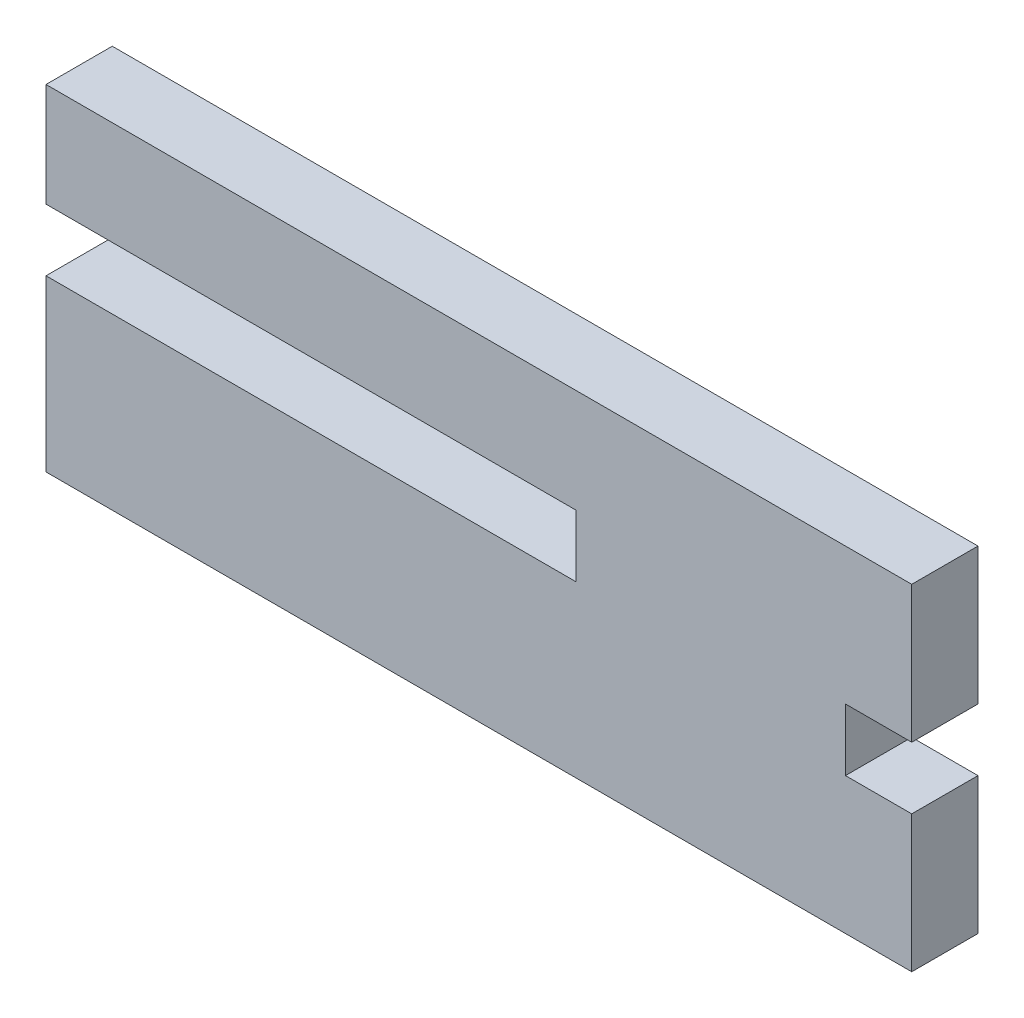
ISO-10303-21;
HEADER;
FILE_DESCRIPTION(('STEP AP214'),'2;1');
FILE_NAME('part.step','',(''),(''),'','','');
FILE_SCHEMA(('AUTOMOTIVE_DESIGN { 1 0 10303 214 1 1 1 1 }'));
ENDSEC;
DATA;
#1=APPLICATION_CONTEXT('core data for automotive mechanical design processes');
#2=APPLICATION_PROTOCOL_DEFINITION('international standard','automotive_design',2000,#1);
#3=PRODUCT_CONTEXT('',#1,'mechanical');
#4=PRODUCT('Part','Part','',(#3));
#5=PRODUCT_RELATED_PRODUCT_CATEGORY('part','',(#4));
#6=PRODUCT_DEFINITION_FORMATION('','',#4);
#7=PRODUCT_DEFINITION_CONTEXT('part definition',#1,'design');
#8=PRODUCT_DEFINITION('design','',#6,#7);
#9=PRODUCT_DEFINITION_SHAPE('','',#8);
#10=(LENGTH_UNIT() NAMED_UNIT(*) SI_UNIT(.MILLI.,.METRE.));
#11=(NAMED_UNIT(*) PLANE_ANGLE_UNIT() SI_UNIT($,.RADIAN.));
#12=(NAMED_UNIT(*) SI_UNIT($,.STERADIAN.) SOLID_ANGLE_UNIT());
#13=UNCERTAINTY_MEASURE_WITH_UNIT(LENGTH_MEASURE(1.E-05),#10,'distance_accuracy_value','');
#14=(GEOMETRIC_REPRESENTATION_CONTEXT(3) GLOBAL_UNCERTAINTY_ASSIGNED_CONTEXT((#13)) GLOBAL_UNIT_ASSIGNED_CONTEXT((#10,
#11,#12)) REPRESENTATION_CONTEXT('',''));
#15=CARTESIAN_POINT('',(0.,0.,0.));
#16=DIRECTION('',(0.,0.,1.));
#17=DIRECTION('',(1.,0.,0.));
#18=AXIS2_PLACEMENT_3D('',#15,#16,#17);
#19=CARTESIAN_POINT('',(-0.1016,11.0109,3.175));
#20=DIRECTION('',(-1.,0.,0.));
#21=DIRECTION('',(0.,0.,1.));
#22=AXIS2_PLACEMENT_3D('',#19,#20,#21);
#23=PLANE('',#22);
#24=DIRECTION('',(0.,1.,0.));
#25=VECTOR('',#24,1.);
#26=CARTESIAN_POINT('',(-0.1016,11.0109,0.));
#27=LINE('',#26,#25);
#28=CARTESIAN_POINT('',(-0.1016,11.0109,0.));
#29=VERTEX_POINT('',#28);
#30=CARTESIAN_POINT('',(-0.1016,15.9766,0.));
#31=VERTEX_POINT('',#30);
#32=EDGE_CURVE('E155',#29,#31,#27,.T.);
#33=ORIENTED_EDGE('',*,*,#32,.F.);
#34=DIRECTION('',(0.,0.,-1.));
#35=VECTOR('',#34,1.);
#36=CARTESIAN_POINT('',(-0.1016,11.0109,3.175));
#37=LINE('',#36,#35);
#38=CARTESIAN_POINT('',(-0.1016,11.0109,3.175));
#39=VERTEX_POINT('',#38);
#40=EDGE_CURVE('E11',#39,#29,#37,.T.);
#41=ORIENTED_EDGE('',*,*,#40,.F.);
#42=DIRECTION('',(0.,1.,0.));
#43=VECTOR('',#42,1.);
#44=CARTESIAN_POINT('',(-0.1016,11.0109,3.175));
#45=LINE('',#44,#43);
#46=CARTESIAN_POINT('',(-0.1016,15.9766,3.175));
#47=VERTEX_POINT('',#46);
#48=EDGE_CURVE('E184',#39,#47,#45,.T.);
#49=ORIENTED_EDGE('',*,*,#48,.T.);
#50=DIRECTION('',(0.,0.,-1.));
#51=VECTOR('',#50,1.);
#52=CARTESIAN_POINT('',(-0.1016,15.9766,3.175));
#53=LINE('',#52,#51);
#54=EDGE_CURVE('E36',#47,#31,#53,.T.);
#55=ORIENTED_EDGE('',*,*,#54,.T.);
#56=EDGE_LOOP('',(#33,#41,#49,#55));
#57=FACE_BOUND('',#56,.T.);
#58=ADVANCED_FACE('F33',(#57),#23,.T.);
#59=CARTESIAN_POINT('',(-0.1016,11.0109,3.175));
#60=DIRECTION('',(0.,1.,0.));
#61=DIRECTION('',(0.,0.,1.));
#62=AXIS2_PLACEMENT_3D('',#59,#60,#61);
#63=PLANE('',#62);
#64=DIRECTION('',(1.,0.,0.));
#65=VECTOR('',#64,1.);
#66=CARTESIAN_POINT('',(-0.1016,11.0109,0.));
#67=LINE('',#66,#65);
#68=CARTESIAN_POINT('',(25.2984,11.0109,0.));
#69=VERTEX_POINT('',#68);
#70=EDGE_CURVE('E90',#29,#69,#67,.T.);
#71=ORIENTED_EDGE('',*,*,#70,.T.);
#72=DIRECTION('',(0.,0.,-1.));
#73=VECTOR('',#72,1.);
#74=CARTESIAN_POINT('',(25.2984,11.0109,3.175));
#75=LINE('',#74,#73);
#76=CARTESIAN_POINT('',(25.2984,11.0109,3.175));
#77=VERTEX_POINT('',#76);
#78=EDGE_CURVE('E42',#77,#69,#75,.T.);
#79=ORIENTED_EDGE('',*,*,#78,.F.);
#80=DIRECTION('',(1.,0.,0.));
#81=VECTOR('',#80,1.);
#82=CARTESIAN_POINT('',(-0.1016,11.0109,3.175));
#83=LINE('',#82,#81);
#84=EDGE_CURVE('E133',#39,#77,#83,.T.);
#85=ORIENTED_EDGE('',*,*,#84,.F.);
#86=ORIENTED_EDGE('',*,*,#40,.T.);
#87=EDGE_LOOP('',(#71,#79,#85,#86));
#88=FACE_BOUND('',#87,.T.);
#89=ADVANCED_FACE('F260',(#88),#63,.F.);
#90=CARTESIAN_POINT('',(25.2984,11.0109,3.175));
#91=DIRECTION('',(1.,0.,0.));
#92=DIRECTION('',(0.,0.,-1.));
#93=AXIS2_PLACEMENT_3D('',#90,#91,#92);
#94=PLANE('',#93);
#95=DIRECTION('',(0.,-1.,0.));
#96=VECTOR('',#95,1.);
#97=CARTESIAN_POINT('',(25.2984,11.0109,0.));
#98=LINE('',#97,#96);
#99=CARTESIAN_POINT('',(25.2984,8.0391,0.));
#100=VERTEX_POINT('',#99);
#101=EDGE_CURVE('E140',#69,#100,#98,.T.);
#102=ORIENTED_EDGE('',*,*,#101,.T.);
#103=DIRECTION('',(0.,0.,-1.));
#104=VECTOR('',#103,1.);
#105=CARTESIAN_POINT('',(25.2984,8.0391,3.175));
#106=LINE('',#105,#104);
#107=CARTESIAN_POINT('',(25.2984,8.0391,3.175));
#108=VERTEX_POINT('',#107);
#109=EDGE_CURVE('E137',#108,#100,#106,.T.);
#110=ORIENTED_EDGE('',*,*,#109,.F.);
#111=DIRECTION('',(0.,-1.,0.));
#112=VECTOR('',#111,1.);
#113=CARTESIAN_POINT('',(25.2984,11.0109,3.175));
#114=LINE('',#113,#112);
#115=EDGE_CURVE('E126',#77,#108,#114,.T.);
#116=ORIENTED_EDGE('',*,*,#115,.F.);
#117=ORIENTED_EDGE('',*,*,#78,.T.);
#118=EDGE_LOOP('',(#102,#110,#116,#117));
#119=FACE_BOUND('',#118,.T.);
#120=ADVANCED_FACE('F138',(#119),#94,.F.);
#121=CARTESIAN_POINT('',(-0.1016,8.0391,3.175));
#122=DIRECTION('',(0.,1.,0.));
#123=DIRECTION('',(0.,0.,1.));
#124=AXIS2_PLACEMENT_3D('',#121,#122,#123);
#125=PLANE('',#124);
#126=DIRECTION('',(1.,0.,0.));
#127=VECTOR('',#126,1.);
#128=CARTESIAN_POINT('',(-0.1016,8.0391,0.));
#129=LINE('',#128,#127);
#130=CARTESIAN_POINT('',(-0.1016,8.0391,0.));
#131=VERTEX_POINT('',#130);
#132=EDGE_CURVE('E181',#131,#100,#129,.T.);
#133=ORIENTED_EDGE('',*,*,#132,.F.);
#134=DIRECTION('',(0.,0.,-1.));
#135=VECTOR('',#134,1.);
#136=CARTESIAN_POINT('',(-0.1016,8.0391,3.175));
#137=LINE('',#136,#135);
#138=CARTESIAN_POINT('',(-0.1016,8.0391,3.175));
#139=VERTEX_POINT('',#138);
#140=EDGE_CURVE('E144',#139,#131,#137,.T.);
#141=ORIENTED_EDGE('',*,*,#140,.F.);
#142=DIRECTION('',(1.,0.,0.));
#143=VECTOR('',#142,1.);
#144=CARTESIAN_POINT('',(-0.1016,8.0391,3.175));
#145=LINE('',#144,#143);
#146=EDGE_CURVE('E132',#139,#108,#145,.T.);
#147=ORIENTED_EDGE('',*,*,#146,.T.);
#148=ORIENTED_EDGE('',*,*,#109,.T.);
#149=EDGE_LOOP('',(#133,#141,#147,#148));
#150=FACE_BOUND('',#149,.T.);
#151=ADVANCED_FACE('F147',(#150),#125,.T.);
#152=CARTESIAN_POINT('',(-0.1016,4.7625,3.175));
#153=DIRECTION('',(-1.,0.,0.));
#154=DIRECTION('',(0.,0.,1.));
#155=AXIS2_PLACEMENT_3D('',#152,#153,#154);
#156=PLANE('',#155);
#157=DIRECTION('',(0.,1.,0.));
#158=VECTOR('',#157,1.);
#159=CARTESIAN_POINT('',(-0.1016,4.7625,0.));
#160=LINE('',#159,#158);
#161=CARTESIAN_POINT('',(-0.1016,-0.1016,0.));
#162=VERTEX_POINT('',#161);
#163=EDGE_CURVE('E178',#162,#131,#160,.T.);
#164=ORIENTED_EDGE('',*,*,#163,.F.);
#165=DIRECTION('',(0.,0.,-1.));
#166=VECTOR('',#165,1.);
#167=CARTESIAN_POINT('',(-0.1016,-0.1016,3.175));
#168=LINE('',#167,#166);
#169=CARTESIAN_POINT('',(-0.1016,-0.1016,3.175));
#170=VERTEX_POINT('',#169);
#171=EDGE_CURVE('E188',#170,#162,#168,.T.);
#172=ORIENTED_EDGE('',*,*,#171,.F.);
#173=DIRECTION('',(0.,1.,0.));
#174=VECTOR('',#173,1.);
#175=CARTESIAN_POINT('',(-0.1016,-0.1016,3.175));
#176=LINE('',#175,#174);
#177=EDGE_CURVE('E148',#170,#139,#176,.T.);
#178=ORIENTED_EDGE('',*,*,#177,.T.);
#179=ORIENTED_EDGE('',*,*,#140,.T.);
#180=EDGE_LOOP('',(#164,#172,#178,#179));
#181=FACE_BOUND('',#180,.T.);
#182=ADVANCED_FACE('F209',(#181),#156,.T.);
#183=CARTESIAN_POINT('',(-0.1016,-0.1016,3.175));
#184=DIRECTION('',(0.,1.,0.));
#185=DIRECTION('',(0.,0.,1.));
#186=AXIS2_PLACEMENT_3D('',#183,#184,#185);
#187=PLANE('',#186);
#188=DIRECTION('',(1.,0.,0.));
#189=VECTOR('',#188,1.);
#190=CARTESIAN_POINT('',(-0.1016,-0.1016,0.));
#191=LINE('',#190,#189);
#192=CARTESIAN_POINT('',(41.3766,-0.1016,0.));
#193=VERTEX_POINT('',#192);
#194=EDGE_CURVE('E176',#162,#193,#191,.T.);
#195=ORIENTED_EDGE('',*,*,#194,.T.);
#196=DIRECTION('',(0.,0.,-1.));
#197=VECTOR('',#196,1.);
#198=CARTESIAN_POINT('',(41.3766,-0.1016,3.175));
#199=LINE('',#198,#197);
#200=CARTESIAN_POINT('',(41.3766,-0.1016,3.175));
#201=VERTEX_POINT('',#200);
#202=EDGE_CURVE('E191',#201,#193,#199,.T.);
#203=ORIENTED_EDGE('',*,*,#202,.F.);
#204=DIRECTION('',(1.,0.,0.));
#205=VECTOR('',#204,1.);
#206=CARTESIAN_POINT('',(25.4,-0.1016,3.175));
#207=LINE('',#206,#205);
#208=EDGE_CURVE('E150',#170,#201,#207,.T.);
#209=ORIENTED_EDGE('',*,*,#208,.F.);
#210=ORIENTED_EDGE('',*,*,#171,.T.);
#211=EDGE_LOOP('',(#195,#203,#209,#210));
#212=FACE_BOUND('',#211,.T.);
#213=ADVANCED_FACE('F211',(#212),#187,.F.);
#214=CARTESIAN_POINT('',(41.3766,6.4516,3.175));
#215=DIRECTION('',(1.,0.,0.));
#216=DIRECTION('',(0.,0.,-1.));
#217=AXIS2_PLACEMENT_3D('',#214,#215,#216);
#218=PLANE('',#217);
#219=DIRECTION('',(0.,-1.,0.));
#220=VECTOR('',#219,1.);
#221=CARTESIAN_POINT('',(41.3766,6.4516,0.));
#222=LINE('',#221,#220);
#223=CARTESIAN_POINT('',(41.3766,6.4516,0.));
#224=VERTEX_POINT('',#223);
#225=EDGE_CURVE('E173',#224,#193,#222,.T.);
#226=ORIENTED_EDGE('',*,*,#225,.F.);
#227=DIRECTION('',(0.,0.,-1.));
#228=VECTOR('',#227,1.);
#229=CARTESIAN_POINT('',(41.3766,6.4516,3.175));
#230=LINE('',#229,#228);
#231=CARTESIAN_POINT('',(41.3766,6.4516,3.175));
#232=VERTEX_POINT('',#231);
#233=EDGE_CURVE('E194',#232,#224,#230,.T.);
#234=ORIENTED_EDGE('',*,*,#233,.F.);
#235=DIRECTION('',(0.,-1.,0.));
#236=VECTOR('',#235,1.);
#237=CARTESIAN_POINT('',(41.3766,6.4516,3.175));
#238=LINE('',#237,#236);
#239=EDGE_CURVE('E215',#232,#201,#238,.T.);
#240=ORIENTED_EDGE('',*,*,#239,.T.);
#241=ORIENTED_EDGE('',*,*,#202,.T.);
#242=EDGE_LOOP('',(#226,#234,#240,#241));
#243=FACE_BOUND('',#242,.T.);
#244=ADVANCED_FACE('F250',(#243),#218,.T.);
#245=CARTESIAN_POINT('',(38.2016,6.4516,3.175));
#246=DIRECTION('',(0.,1.,0.));
#247=DIRECTION('',(0.,0.,1.));
#248=AXIS2_PLACEMENT_3D('',#245,#246,#247);
#249=PLANE('',#248);
#250=DIRECTION('',(1.,0.,0.));
#251=VECTOR('',#250,1.);
#252=CARTESIAN_POINT('',(38.2016,6.4516,0.));
#253=LINE('',#252,#251);
#254=CARTESIAN_POINT('',(38.2016,6.4516,0.));
#255=VERTEX_POINT('',#254);
#256=EDGE_CURVE('E170',#255,#224,#253,.T.);
#257=ORIENTED_EDGE('',*,*,#256,.F.);
#258=DIRECTION('',(0.,0.,-1.));
#259=VECTOR('',#258,1.);
#260=CARTESIAN_POINT('',(38.2016,6.4516,3.175));
#261=LINE('',#260,#259);
#262=CARTESIAN_POINT('',(38.2016,6.4516,3.175));
#263=VERTEX_POINT('',#262);
#264=EDGE_CURVE('E196',#263,#255,#261,.T.);
#265=ORIENTED_EDGE('',*,*,#264,.F.);
#266=DIRECTION('',(1.,0.,0.));
#267=VECTOR('',#266,1.);
#268=CARTESIAN_POINT('',(38.2016,6.4516,3.175));
#269=LINE('',#268,#267);
#270=EDGE_CURVE('E216',#263,#232,#269,.T.);
#271=ORIENTED_EDGE('',*,*,#270,.T.);
#272=ORIENTED_EDGE('',*,*,#233,.T.);
#273=EDGE_LOOP('',(#257,#265,#271,#272));
#274=FACE_BOUND('',#273,.T.);
#275=ADVANCED_FACE('F247',(#274),#249,.T.);
#276=CARTESIAN_POINT('',(38.2016,9.4234,3.175));
#277=DIRECTION('',(1.,0.,0.));
#278=DIRECTION('',(0.,0.,-1.));
#279=AXIS2_PLACEMENT_3D('',#276,#277,#278);
#280=PLANE('',#279);
#281=DIRECTION('',(0.,-1.,0.));
#282=VECTOR('',#281,1.);
#283=CARTESIAN_POINT('',(38.2016,9.4234,0.));
#284=LINE('',#283,#282);
#285=CARTESIAN_POINT('',(38.2016,9.4234,0.));
#286=VERTEX_POINT('',#285);
#287=EDGE_CURVE('E167',#286,#255,#284,.T.);
#288=ORIENTED_EDGE('',*,*,#287,.F.);
#289=DIRECTION('',(0.,0.,-1.));
#290=VECTOR('',#289,1.);
#291=CARTESIAN_POINT('',(38.2016,9.4234,3.175));
#292=LINE('',#291,#290);
#293=CARTESIAN_POINT('',(38.2016,9.4234,3.175));
#294=VERTEX_POINT('',#293);
#295=EDGE_CURVE('E198',#294,#286,#292,.T.);
#296=ORIENTED_EDGE('',*,*,#295,.F.);
#297=DIRECTION('',(0.,-1.,0.));
#298=VECTOR('',#297,1.);
#299=CARTESIAN_POINT('',(38.2016,9.4234,3.175));
#300=LINE('',#299,#298);
#301=EDGE_CURVE('E221',#294,#263,#300,.T.);
#302=ORIENTED_EDGE('',*,*,#301,.T.);
#303=ORIENTED_EDGE('',*,*,#264,.T.);
#304=EDGE_LOOP('',(#288,#296,#302,#303));
#305=FACE_BOUND('',#304,.T.);
#306=ADVANCED_FACE('F244',(#305),#280,.T.);
#307=CARTESIAN_POINT('',(38.2016,9.4234,3.175));
#308=DIRECTION('',(0.,1.,0.));
#309=DIRECTION('',(0.,0.,1.));
#310=AXIS2_PLACEMENT_3D('',#307,#308,#309);
#311=PLANE('',#310);
#312=DIRECTION('',(1.,0.,0.));
#313=VECTOR('',#312,1.);
#314=CARTESIAN_POINT('',(38.2016,9.4234,0.));
#315=LINE('',#314,#313);
#316=CARTESIAN_POINT('',(41.3766,9.4234,0.));
#317=VERTEX_POINT('',#316);
#318=EDGE_CURVE('E164',#286,#317,#315,.T.);
#319=ORIENTED_EDGE('',*,*,#318,.T.);
#320=DIRECTION('',(0.,0.,-1.));
#321=VECTOR('',#320,1.);
#322=CARTESIAN_POINT('',(41.3766,9.4234,3.175));
#323=LINE('',#322,#321);
#324=CARTESIAN_POINT('',(41.3766,9.4234,3.175));
#325=VERTEX_POINT('',#324);
#326=EDGE_CURVE('E200',#325,#317,#323,.T.);
#327=ORIENTED_EDGE('',*,*,#326,.F.);
#328=DIRECTION('',(1.,0.,0.));
#329=VECTOR('',#328,1.);
#330=CARTESIAN_POINT('',(38.2016,9.4234,3.175));
#331=LINE('',#330,#329);
#332=EDGE_CURVE('E224',#294,#325,#331,.T.);
#333=ORIENTED_EDGE('',*,*,#332,.F.);
#334=ORIENTED_EDGE('',*,*,#295,.T.);
#335=EDGE_LOOP('',(#319,#327,#333,#334));
#336=FACE_BOUND('',#335,.T.);
#337=ADVANCED_FACE('F240',(#336),#311,.F.);
#338=CARTESIAN_POINT('',(41.3766,15.9766,3.175));
#339=DIRECTION('',(1.,0.,0.));
#340=DIRECTION('',(0.,0.,-1.));
#341=AXIS2_PLACEMENT_3D('',#338,#339,#340);
#342=PLANE('',#341);
#343=DIRECTION('',(0.,-1.,0.));
#344=VECTOR('',#343,1.);
#345=CARTESIAN_POINT('',(41.3766,15.9766,0.));
#346=LINE('',#345,#344);
#347=CARTESIAN_POINT('',(41.3766,15.9766,0.));
#348=VERTEX_POINT('',#347);
#349=EDGE_CURVE('E161',#348,#317,#346,.T.);
#350=ORIENTED_EDGE('',*,*,#349,.F.);
#351=DIRECTION('',(0.,0.,-1.));
#352=VECTOR('',#351,1.);
#353=CARTESIAN_POINT('',(41.3766,15.9766,3.175));
#354=LINE('',#353,#352);
#355=CARTESIAN_POINT('',(41.3766,15.9766,3.175));
#356=VERTEX_POINT('',#355);
#357=EDGE_CURVE('E201',#356,#348,#354,.T.);
#358=ORIENTED_EDGE('',*,*,#357,.F.);
#359=DIRECTION('',(0.,-1.,0.));
#360=VECTOR('',#359,1.);
#361=CARTESIAN_POINT('',(41.3766,15.9766,3.175));
#362=LINE('',#361,#360);
#363=EDGE_CURVE('E226',#356,#325,#362,.T.);
#364=ORIENTED_EDGE('',*,*,#363,.T.);
#365=ORIENTED_EDGE('',*,*,#326,.T.);
#366=EDGE_LOOP('',(#350,#358,#364,#365));
#367=FACE_BOUND('',#366,.T.);
#368=ADVANCED_FACE('F234',(#367),#342,.T.);
#369=CARTESIAN_POINT('',(25.4,15.9766,3.175));
#370=DIRECTION('',(0.,1.,0.));
#371=DIRECTION('',(0.,0.,1.));
#372=AXIS2_PLACEMENT_3D('',#369,#370,#371);
#373=PLANE('',#372);
#374=DIRECTION('',(1.,0.,0.));
#375=VECTOR('',#374,1.);
#376=CARTESIAN_POINT('',(25.4,15.9766,0.));
#377=LINE('',#376,#375);
#378=EDGE_CURVE('E158',#31,#348,#377,.T.);
#379=ORIENTED_EDGE('',*,*,#378,.F.);
#380=ORIENTED_EDGE('',*,*,#54,.F.);
#381=DIRECTION('',(1.,0.,0.));
#382=VECTOR('',#381,1.);
#383=CARTESIAN_POINT('',(-0.1016,15.9766,3.175));
#384=LINE('',#383,#382);
#385=EDGE_CURVE('E229',#47,#356,#384,.T.);
#386=ORIENTED_EDGE('',*,*,#385,.T.);
#387=ORIENTED_EDGE('',*,*,#357,.T.);
#388=EDGE_LOOP('',(#379,#380,#386,#387));
#389=FACE_BOUND('',#388,.T.);
#390=ADVANCED_FACE('F231',(#389),#373,.T.);
#391=CARTESIAN_POINT('',(0.,0.,3.175));
#392=DIRECTION('',(0.,0.,-1.));
#393=DIRECTION('',(-1.,0.,0.));
#394=AXIS2_PLACEMENT_3D('',#391,#392,#393);
#395=PLANE('',#394);
#396=ORIENTED_EDGE('',*,*,#48,.F.);
#397=ORIENTED_EDGE('',*,*,#84,.T.);
#398=ORIENTED_EDGE('',*,*,#115,.T.);
#399=ORIENTED_EDGE('',*,*,#146,.F.);
#400=ORIENTED_EDGE('',*,*,#177,.F.);
#401=ORIENTED_EDGE('',*,*,#208,.T.);
#402=ORIENTED_EDGE('',*,*,#239,.F.);
#403=ORIENTED_EDGE('',*,*,#270,.F.);
#404=ORIENTED_EDGE('',*,*,#301,.F.);
#405=ORIENTED_EDGE('',*,*,#332,.T.);
#406=ORIENTED_EDGE('',*,*,#363,.F.);
#407=ORIENTED_EDGE('',*,*,#385,.F.);
#408=EDGE_LOOP('',(#396,#397,#398,#399,#400,#401,#402,#403,#404,#405,#406,#407));
#409=FACE_BOUND('',#408,.T.);
#410=ADVANCED_FACE('F129',(#409),#395,.F.);
#411=CARTESIAN_POINT('',(0.,0.,0.));
#412=DIRECTION('',(0.,0.,-1.));
#413=DIRECTION('',(-1.,0.,0.));
#414=AXIS2_PLACEMENT_3D('',#411,#412,#413);
#415=PLANE('',#414);
#416=ORIENTED_EDGE('',*,*,#32,.T.);
#417=ORIENTED_EDGE('',*,*,#378,.T.);
#418=ORIENTED_EDGE('',*,*,#349,.T.);
#419=ORIENTED_EDGE('',*,*,#318,.F.);
#420=ORIENTED_EDGE('',*,*,#287,.T.);
#421=ORIENTED_EDGE('',*,*,#256,.T.);
#422=ORIENTED_EDGE('',*,*,#225,.T.);
#423=ORIENTED_EDGE('',*,*,#194,.F.);
#424=ORIENTED_EDGE('',*,*,#163,.T.);
#425=ORIENTED_EDGE('',*,*,#132,.T.);
#426=ORIENTED_EDGE('',*,*,#101,.F.);
#427=ORIENTED_EDGE('',*,*,#70,.F.);
#428=EDGE_LOOP('',(#416,#417,#418,#419,#420,#421,#422,#423,#424,#425,#426,#427));
#429=FACE_BOUND('',#428,.T.);
#430=ADVANCED_FACE('F205',(#429),#415,.T.);
#431=CLOSED_SHELL('',(#58,#89,#120,#151,#182,#213,#244,#275,#306,#337,#368,#390,#410,#430));
#432=MANIFOLD_SOLID_BREP('B2',#431);
#433=ADVANCED_BREP_SHAPE_REPRESENTATION('',(#18,#432),#14);
#434=SHAPE_DEFINITION_REPRESENTATION(#9,#433);
ENDSEC;
END-ISO-10303-21;
